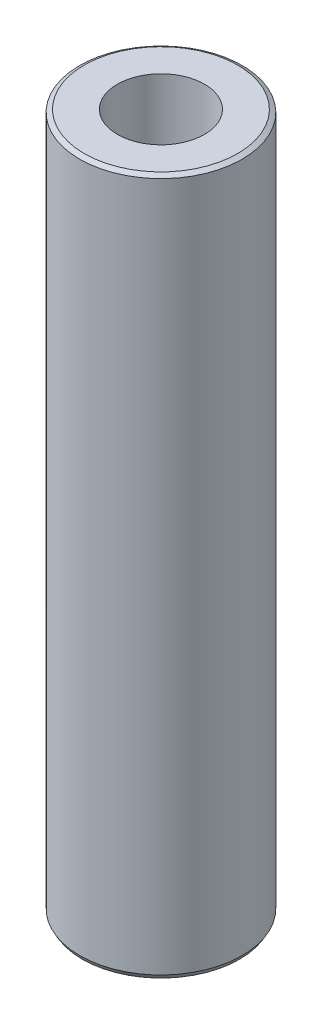
ISO-10303-21;
HEADER;
FILE_DESCRIPTION(('STEP AP214'),'2;1');
FILE_NAME('part.step','',(''),(''),'','','');
FILE_SCHEMA(('AUTOMOTIVE_DESIGN { 1 0 10303 214 1 1 1 1 }'));
ENDSEC;
DATA;
#1=APPLICATION_CONTEXT('core data for automotive mechanical design processes');
#2=APPLICATION_PROTOCOL_DEFINITION('international standard','automotive_design',2000,#1);
#3=PRODUCT_CONTEXT('',#1,'mechanical');
#4=PRODUCT('Part','Part','',(#3));
#5=PRODUCT_RELATED_PRODUCT_CATEGORY('part','',(#4));
#6=PRODUCT_DEFINITION_FORMATION('','',#4);
#7=PRODUCT_DEFINITION_CONTEXT('part definition',#1,'design');
#8=PRODUCT_DEFINITION('design','',#6,#7);
#9=PRODUCT_DEFINITION_SHAPE('','',#8);
#10=(LENGTH_UNIT() NAMED_UNIT(*) SI_UNIT(.MILLI.,.METRE.));
#11=(NAMED_UNIT(*) PLANE_ANGLE_UNIT() SI_UNIT($,.RADIAN.));
#12=(NAMED_UNIT(*) SI_UNIT($,.STERADIAN.) SOLID_ANGLE_UNIT());
#13=UNCERTAINTY_MEASURE_WITH_UNIT(LENGTH_MEASURE(1.E-05),#10,'distance_accuracy_value','');
#14=(GEOMETRIC_REPRESENTATION_CONTEXT(3) GLOBAL_UNCERTAINTY_ASSIGNED_CONTEXT((#13)) GLOBAL_UNIT_ASSIGNED_CONTEXT((#10,
#11,#12)) REPRESENTATION_CONTEXT('',''));
#15=CARTESIAN_POINT('',(0.,0.,0.));
#16=DIRECTION('',(0.,0.,1.));
#17=DIRECTION('',(1.,0.,0.));
#18=AXIS2_PLACEMENT_3D('',#15,#16,#17);
#19=CARTESIAN_POINT('',(0.,364.540746162367,0.));
#20=DIRECTION('',(0.,-1.,0.));
#21=DIRECTION('',(0.,0.,-1.));
#22=AXIS2_PLACEMENT_3D('',#19,#20,#21);
#23=CYLINDRICAL_SURFACE('',#22,42.5);
#24=CARTESIAN_POINT('',(0.,363.173828257867,0.));
#25=DIRECTION('',(0.,1.,0.));
#26=DIRECTION('',(0.,0.,1.));
#27=AXIS2_PLACEMENT_3D('',#24,#25,#26);
#28=CIRCLE('',#27,42.5);
#29=CARTESIAN_POINT('',(0.,363.173828257867,42.5));
#30=VERTEX_POINT('',#29);
#31=EDGE_CURVE('E50',#30,#30,#28,.F.);
#32=ORIENTED_EDGE('',*,*,#31,.T.);
#33=EDGE_LOOP('',(#32));
#34=FACE_BOUND('',#33,.T.);
#35=CARTESIAN_POINT('',(0.,2.36757126036952,0.));
#36=DIRECTION('',(0.,1.,0.));
#37=DIRECTION('',(0.,0.,1.));
#38=AXIS2_PLACEMENT_3D('',#35,#36,#37);
#39=CIRCLE('',#38,42.5);
#40=CARTESIAN_POINT('',(0.,2.36757126036952,42.5));
#41=VERTEX_POINT('',#40);
#42=EDGE_CURVE('E51',#41,#41,#39,.T.);
#43=ORIENTED_EDGE('',*,*,#42,.T.);
#44=EDGE_LOOP('',(#43));
#45=FACE_BOUND('',#44,.T.);
#46=ADVANCED_FACE('F39',(#34,#45),#23,.T.);
#47=CARTESIAN_POINT('',(0.,364.540746162367,0.));
#48=DIRECTION('',(0.,1.,0.));
#49=DIRECTION('',(0.,0.,1.));
#50=AXIS2_PLACEMENT_3D('',#47,#48,#49);
#51=PLANE('',#50);
#52=CARTESIAN_POINT('',(0.,364.540746162367,0.));
#53=DIRECTION('',(0.,1.,0.));
#54=DIRECTION('',(0.,0.,1.));
#55=AXIS2_PLACEMENT_3D('',#52,#53,#54);
#56=CIRCLE('',#55,40.1324287396307);
#57=CARTESIAN_POINT('',(0.,364.540746162367,40.1324287396307));
#58=VERTEX_POINT('',#57);
#59=EDGE_CURVE('E54',#58,#58,#56,.T.);
#60=ORIENTED_EDGE('',*,*,#59,.T.);
#61=EDGE_LOOP('',(#60));
#62=FACE_BOUND('',#61,.T.);
#63=CARTESIAN_POINT('',(0.,364.540746162367,0.));
#64=DIRECTION('',(0.,1.,0.));
#65=DIRECTION('',(0.,0.,1.));
#66=AXIS2_PLACEMENT_3D('',#63,#64,#65);
#67=CIRCLE('',#66,22.7816109537783);
#68=CARTESIAN_POINT('',(0.,364.540746162367,22.7816109537783));
#69=VERTEX_POINT('',#68);
#70=EDGE_CURVE('E58',#69,#69,#67,.T.);
#71=ORIENTED_EDGE('',*,*,#70,.F.);
#72=EDGE_LOOP('',(#71));
#73=FACE_BOUND('',#72,.T.);
#74=ADVANCED_FACE('F69',(#62,#73),#51,.T.);
#75=CARTESIAN_POINT('',(0.,0.,0.));
#76=DIRECTION('',(0.,1.,0.));
#77=DIRECTION('',(0.,0.,1.));
#78=AXIS2_PLACEMENT_3D('',#75,#76,#77);
#79=PLANE('',#78);
#80=CARTESIAN_POINT('',(0.,0.,0.));
#81=DIRECTION('',(0.,1.,0.));
#82=DIRECTION('',(0.,0.,1.));
#83=AXIS2_PLACEMENT_3D('',#80,#81,#82);
#84=CIRCLE('',#83,41.1330820955);
#85=CARTESIAN_POINT('',(0.,0.,41.1330820955));
#86=VERTEX_POINT('',#85);
#87=EDGE_CURVE('E10',#86,#86,#84,.F.);
#88=ORIENTED_EDGE('',*,*,#87,.T.);
#89=EDGE_LOOP('',(#88));
#90=FACE_BOUND('',#89,.T.);
#91=CARTESIAN_POINT('',(0.,0.,0.));
#92=DIRECTION('',(0.,1.,0.));
#93=DIRECTION('',(0.,0.,1.));
#94=AXIS2_PLACEMENT_3D('',#91,#92,#93);
#95=CIRCLE('',#94,22.7816109537783);
#96=CARTESIAN_POINT('',(0.,0.,22.7816109537783));
#97=VERTEX_POINT('',#96);
#98=EDGE_CURVE('E63',#97,#97,#95,.T.);
#99=ORIENTED_EDGE('',*,*,#98,.T.);
#100=EDGE_LOOP('',(#99));
#101=FACE_BOUND('',#100,.T.);
#102=ADVANCED_FACE('F75',(#90,#101),#79,.F.);
#103=CARTESIAN_POINT('',(0.,364.540746162367,0.));
#104=DIRECTION('',(0.,-1.,0.));
#105=DIRECTION('',(0.,0.,-1.));
#106=AXIS2_PLACEMENT_3D('',#103,#104,#105);
#107=CYLINDRICAL_SURFACE('',#106,22.7816109537783);
#108=ORIENTED_EDGE('',*,*,#70,.T.);
#109=EDGE_LOOP('',(#108));
#110=FACE_BOUND('',#109,.T.);
#111=ORIENTED_EDGE('',*,*,#98,.F.);
#112=EDGE_LOOP('',(#111));
#113=FACE_BOUND('',#112,.T.);
#114=ADVANCED_FACE('F70',(#110,#113),#107,.F.);
#115=CARTESIAN_POINT('',(0.,364.540746162367,0.));
#116=DIRECTION('',(0.,-1.,0.));
#117=DIRECTION('',(0.,0.,-1.));
#118=AXIS2_PLACEMENT_3D('',#115,#116,#117);
#119=CONICAL_SURFACE('',#118,40.1324287396307,1.04719755119659);
#120=ORIENTED_EDGE('',*,*,#31,.F.);
#121=EDGE_LOOP('',(#120));
#122=FACE_BOUND('',#121,.T.);
#123=ORIENTED_EDGE('',*,*,#59,.F.);
#124=EDGE_LOOP('',(#123));
#125=FACE_BOUND('',#124,.T.);
#126=ADVANCED_FACE('F81',(#122,#125),#119,.T.);
#127=CARTESIAN_POINT('',(0.,2.36757126036952,0.));
#128=DIRECTION('',(0.,1.,0.));
#129=DIRECTION('',(0.,0.,1.));
#130=AXIS2_PLACEMENT_3D('',#127,#128,#129);
#131=CONICAL_SURFACE('',#130,42.5,0.523598775598301);
#132=ORIENTED_EDGE('',*,*,#87,.F.);
#133=EDGE_LOOP('',(#132));
#134=FACE_BOUND('',#133,.T.);
#135=ORIENTED_EDGE('',*,*,#42,.F.);
#136=EDGE_LOOP('',(#135));
#137=FACE_BOUND('',#136,.T.);
#138=ADVANCED_FACE('F45',(#134,#137),#131,.T.);
#139=CLOSED_SHELL('',(#46,#74,#102,#114,#126,#138));
#140=MANIFOLD_SOLID_BREP('B2',#139);
#141=ADVANCED_BREP_SHAPE_REPRESENTATION('',(#18,#140),#14);
#142=SHAPE_DEFINITION_REPRESENTATION(#9,#141);
ENDSEC;
END-ISO-10303-21;
